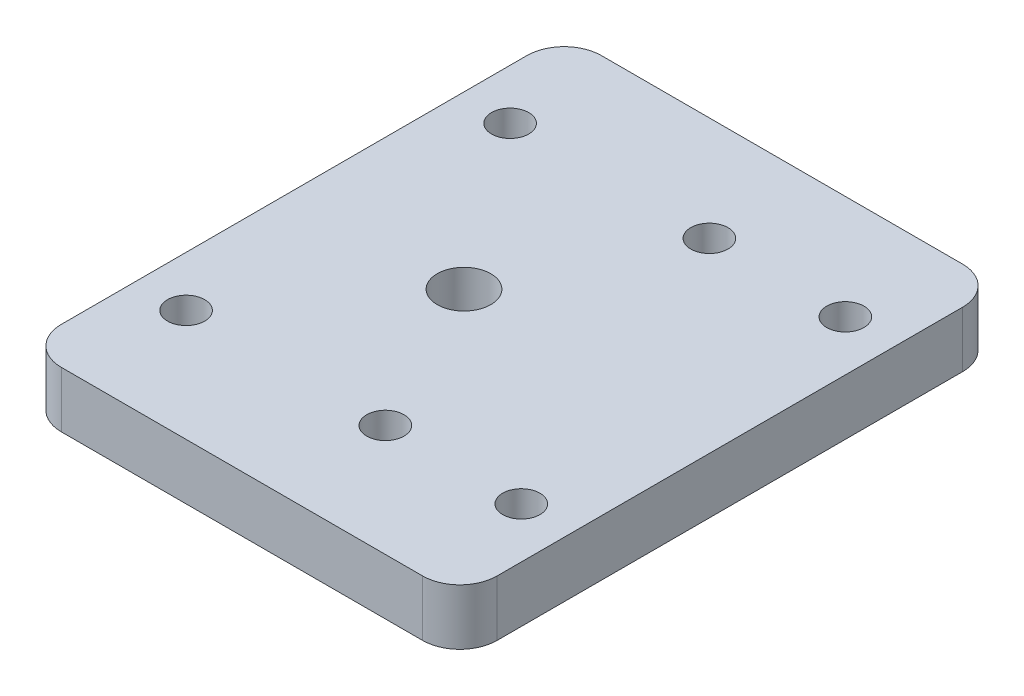
ISO-10303-21;
HEADER;
FILE_DESCRIPTION(('STEP AP214'),'2;1');
FILE_NAME('part.step','',(''),(''),'','','');
FILE_SCHEMA(('AUTOMOTIVE_DESIGN { 1 0 10303 214 1 1 1 1 }'));
ENDSEC;
DATA;
#1=APPLICATION_CONTEXT('core data for automotive mechanical design processes');
#2=APPLICATION_PROTOCOL_DEFINITION('international standard','automotive_design',2000,#1);
#3=PRODUCT_CONTEXT('',#1,'mechanical');
#4=PRODUCT('Part','Part','',(#3));
#5=PRODUCT_RELATED_PRODUCT_CATEGORY('part','',(#4));
#6=PRODUCT_DEFINITION_FORMATION('','',#4);
#7=PRODUCT_DEFINITION_CONTEXT('part definition',#1,'design');
#8=PRODUCT_DEFINITION('design','',#6,#7);
#9=PRODUCT_DEFINITION_SHAPE('','',#8);
#10=(LENGTH_UNIT() NAMED_UNIT(*) SI_UNIT(.MILLI.,.METRE.));
#11=(NAMED_UNIT(*) PLANE_ANGLE_UNIT() SI_UNIT($,.RADIAN.));
#12=(NAMED_UNIT(*) SI_UNIT($,.STERADIAN.) SOLID_ANGLE_UNIT());
#13=UNCERTAINTY_MEASURE_WITH_UNIT(LENGTH_MEASURE(1.E-05),#10,'distance_accuracy_value','');
#14=(GEOMETRIC_REPRESENTATION_CONTEXT(3) GLOBAL_UNCERTAINTY_ASSIGNED_CONTEXT((#13)) GLOBAL_UNIT_ASSIGNED_CONTEXT((#10,
#11,#12)) REPRESENTATION_CONTEXT('',''));
#15=CARTESIAN_POINT('',(0.,0.,0.));
#16=DIRECTION('',(0.,0.,1.));
#17=DIRECTION('',(1.,0.,0.));
#18=AXIS2_PLACEMENT_3D('',#15,#16,#17);
#19=CARTESIAN_POINT('',(0.,3.,0.));
#20=DIRECTION('',(0.,-1.,0.));
#21=DIRECTION('',(0.,0.,-1.));
#22=AXIS2_PLACEMENT_3D('',#19,#20,#21);
#23=PLANE('',#22);
#24=CARTESIAN_POINT('',(-2.52398418704892,3.,0.0532018004494109));
#25=DIRECTION('',(0.,1.,0.));
#26=DIRECTION('',(0.,0.,1.));
#27=AXIS2_PLACEMENT_3D('',#24,#25,#26);
#28=CIRCLE('',#27,1.44);
#29=CARTESIAN_POINT('',(-2.52398418704892,3.,1.49320180044941));
#30=VERTEX_POINT('',#29);
#31=EDGE_CURVE('E209',#30,#30,#28,.T.);
#32=ORIENTED_EDGE('',*,*,#31,.F.);
#33=EDGE_LOOP('',(#32));
#34=FACE_BOUND('',#33,.T.);
#35=CARTESIAN_POINT('',(-9.,3.,-8.9));
#36=DIRECTION('',(0.,1.,0.));
#37=DIRECTION('',(0.,0.,1.));
#38=AXIS2_PLACEMENT_3D('',#35,#36,#37);
#39=CIRCLE('',#38,1.);
#40=CARTESIAN_POINT('',(-9.,3.,-7.9));
#41=VERTEX_POINT('',#40);
#42=EDGE_CURVE('E195',#41,#41,#39,.T.);
#43=ORIENTED_EDGE('',*,*,#42,.F.);
#44=EDGE_LOOP('',(#43));
#45=FACE_BOUND('',#44,.T.);
#46=CARTESIAN_POINT('',(1.7,3.,-8.9));
#47=DIRECTION('',(0.,1.,0.));
#48=DIRECTION('',(0.,0.,1.));
#49=AXIS2_PLACEMENT_3D('',#46,#47,#48);
#50=CIRCLE('',#49,1.);
#51=CARTESIAN_POINT('',(1.7,3.,-7.9));
#52=VERTEX_POINT('',#51);
#53=EDGE_CURVE('E192',#52,#52,#50,.T.);
#54=ORIENTED_EDGE('',*,*,#53,.F.);
#55=EDGE_LOOP('',(#54));
#56=FACE_BOUND('',#55,.T.);
#57=CARTESIAN_POINT('',(9.,3.,-8.9));
#58=DIRECTION('',(0.,1.,0.));
#59=DIRECTION('',(0.,0.,1.));
#60=AXIS2_PLACEMENT_3D('',#57,#58,#59);
#61=CIRCLE('',#60,1.);
#62=CARTESIAN_POINT('',(9.,3.,-7.9));
#63=VERTEX_POINT('',#62);
#64=EDGE_CURVE('E220',#63,#63,#61,.T.);
#65=ORIENTED_EDGE('',*,*,#64,.F.);
#66=EDGE_LOOP('',(#65));
#67=FACE_BOUND('',#66,.T.);
#68=CARTESIAN_POINT('',(9.,3.,8.5));
#69=DIRECTION('',(0.,1.,0.));
#70=DIRECTION('',(0.,0.,-1.));
#71=AXIS2_PLACEMENT_3D('',#68,#69,#70);
#72=CIRCLE('',#71,1.);
#73=CARTESIAN_POINT('',(9.,3.,7.5));
#74=VERTEX_POINT('',#73);
#75=EDGE_CURVE('E147',#74,#74,#72,.T.);
#76=ORIENTED_EDGE('',*,*,#75,.F.);
#77=EDGE_LOOP('',(#76));
#78=FACE_BOUND('',#77,.T.);
#79=DIRECTION('',(0.,0.,-1.));
#80=VECTOR('',#79,1.);
#81=CARTESIAN_POINT('',(11.7,3.,14.5));
#82=LINE('',#81,#80);
#83=CARTESIAN_POINT('',(11.7,3.,12.5));
#84=VERTEX_POINT('',#83);
#85=CARTESIAN_POINT('',(11.7,3.,-12.5));
#86=VERTEX_POINT('',#85);
#87=EDGE_CURVE('E153',#84,#86,#82,.T.);
#88=ORIENTED_EDGE('',*,*,#87,.T.);
#89=CARTESIAN_POINT('',(9.69999999999999,3.,-12.5));
#90=DIRECTION('',(0.,-1.,0.));
#91=DIRECTION('',(0.,0.,-1.));
#92=AXIS2_PLACEMENT_3D('',#89,#90,#91);
#93=CIRCLE('',#92,2.);
#94=CARTESIAN_POINT('',(9.69999999999999,3.,-14.5));
#95=VERTEX_POINT('',#94);
#96=EDGE_CURVE('E177',#86,#95,#93,.F.);
#97=ORIENTED_EDGE('',*,*,#96,.T.);
#98=DIRECTION('',(-1.,0.,0.));
#99=VECTOR('',#98,1.);
#100=CARTESIAN_POINT('',(-11.7,3.,-14.5));
#101=LINE('',#100,#99);
#102=CARTESIAN_POINT('',(-9.7,3.,-14.5));
#103=VERTEX_POINT('',#102);
#104=EDGE_CURVE('E128',#95,#103,#101,.T.);
#105=ORIENTED_EDGE('',*,*,#104,.T.);
#106=CARTESIAN_POINT('',(-9.7,3.,-12.5));
#107=DIRECTION('',(0.,-1.,0.));
#108=DIRECTION('',(0.,0.,-1.));
#109=AXIS2_PLACEMENT_3D('',#106,#107,#108);
#110=CIRCLE('',#109,2.);
#111=CARTESIAN_POINT('',(-11.7,3.,-12.5));
#112=VERTEX_POINT('',#111);
#113=EDGE_CURVE('E169',#103,#112,#110,.F.);
#114=ORIENTED_EDGE('',*,*,#113,.T.);
#115=DIRECTION('',(0.,0.,1.));
#116=VECTOR('',#115,1.);
#117=CARTESIAN_POINT('',(-11.7,3.,14.5));
#118=LINE('',#117,#116);
#119=CARTESIAN_POINT('',(-11.7,3.,12.5));
#120=VERTEX_POINT('',#119);
#121=EDGE_CURVE('E247',#112,#120,#118,.T.);
#122=ORIENTED_EDGE('',*,*,#121,.T.);
#123=CARTESIAN_POINT('',(-9.7,3.,12.5));
#124=DIRECTION('',(0.,-1.,0.));
#125=DIRECTION('',(0.,0.,-1.));
#126=AXIS2_PLACEMENT_3D('',#123,#124,#125);
#127=CIRCLE('',#126,2.);
#128=CARTESIAN_POINT('',(-9.7,3.,14.5));
#129=VERTEX_POINT('',#128);
#130=EDGE_CURVE('E63',#120,#129,#127,.F.);
#131=ORIENTED_EDGE('',*,*,#130,.T.);
#132=DIRECTION('',(1.,0.,0.));
#133=VECTOR('',#132,1.);
#134=CARTESIAN_POINT('',(-11.7,3.,14.5));
#135=LINE('',#134,#133);
#136=CARTESIAN_POINT('',(9.69999999999999,3.,14.5));
#137=VERTEX_POINT('',#136);
#138=EDGE_CURVE('E155',#129,#137,#135,.T.);
#139=ORIENTED_EDGE('',*,*,#138,.T.);
#140=CARTESIAN_POINT('',(9.7,3.,12.5));
#141=DIRECTION('',(0.,-1.,0.));
#142=DIRECTION('',(0.,0.,-1.));
#143=AXIS2_PLACEMENT_3D('',#140,#141,#142);
#144=CIRCLE('',#143,2.);
#145=EDGE_CURVE('E174',#137,#84,#144,.F.);
#146=ORIENTED_EDGE('',*,*,#145,.T.);
#147=EDGE_LOOP('',(#88,#97,#105,#114,#122,#131,#139,#146));
#148=FACE_BOUND('',#147,.T.);
#149=CARTESIAN_POINT('',(-9.,3.,8.5));
#150=DIRECTION('',(0.,1.,0.));
#151=DIRECTION('',(0.,0.,-1.));
#152=AXIS2_PLACEMENT_3D('',#149,#150,#151);
#153=CIRCLE('',#152,1.);
#154=CARTESIAN_POINT('',(-9.,3.,7.5));
#155=VERTEX_POINT('',#154);
#156=EDGE_CURVE('E228',#155,#155,#153,.T.);
#157=ORIENTED_EDGE('',*,*,#156,.F.);
#158=EDGE_LOOP('',(#157));
#159=FACE_BOUND('',#158,.T.);
#160=CARTESIAN_POINT('',(1.7,3.,8.5));
#161=DIRECTION('',(0.,1.,0.));
#162=DIRECTION('',(0.,0.,-1.));
#163=AXIS2_PLACEMENT_3D('',#160,#161,#162);
#164=CIRCLE('',#163,1.);
#165=CARTESIAN_POINT('',(1.7,3.,7.5));
#166=VERTEX_POINT('',#165);
#167=EDGE_CURVE('E212',#166,#166,#164,.T.);
#168=ORIENTED_EDGE('',*,*,#167,.F.);
#169=EDGE_LOOP('',(#168));
#170=FACE_BOUND('',#169,.T.);
#171=ADVANCED_FACE('F38',(#34,#45,#56,#67,#78,#148,#159,#170),#23,.F.);
#172=CARTESIAN_POINT('',(0.,0.,0.));
#173=DIRECTION('',(0.,-1.,0.));
#174=DIRECTION('',(0.,0.,-1.));
#175=AXIS2_PLACEMENT_3D('',#172,#173,#174);
#176=PLANE('',#175);
#177=CARTESIAN_POINT('',(-2.52398418704892,0.,0.0532018004494109));
#178=DIRECTION('',(0.,-1.,0.));
#179=DIRECTION('',(0.,0.,-1.));
#180=AXIS2_PLACEMENT_3D('',#177,#178,#179);
#181=CIRCLE('',#180,1.44);
#182=CARTESIAN_POINT('',(-2.52398418704892,0.,-1.38679819955059));
#183=VERTEX_POINT('',#182);
#184=EDGE_CURVE('E42',#183,#183,#181,.T.);
#185=ORIENTED_EDGE('',*,*,#184,.F.);
#186=EDGE_LOOP('',(#185));
#187=FACE_BOUND('',#186,.T.);
#188=CARTESIAN_POINT('',(-9.,0.,-8.9));
#189=DIRECTION('',(0.,-1.,0.));
#190=DIRECTION('',(0.,0.,-1.));
#191=AXIS2_PLACEMENT_3D('',#188,#189,#190);
#192=CIRCLE('',#191,1.);
#193=CARTESIAN_POINT('',(-9.,0.,-9.9));
#194=VERTEX_POINT('',#193);
#195=EDGE_CURVE('E193',#194,#194,#192,.T.);
#196=ORIENTED_EDGE('',*,*,#195,.F.);
#197=EDGE_LOOP('',(#196));
#198=FACE_BOUND('',#197,.T.);
#199=CARTESIAN_POINT('',(1.7,0.,-8.9));
#200=DIRECTION('',(0.,-1.,0.));
#201=DIRECTION('',(0.,0.,-1.));
#202=AXIS2_PLACEMENT_3D('',#199,#200,#201);
#203=CIRCLE('',#202,1.);
#204=CARTESIAN_POINT('',(1.7,0.,-9.9));
#205=VERTEX_POINT('',#204);
#206=EDGE_CURVE('E188',#205,#205,#203,.T.);
#207=ORIENTED_EDGE('',*,*,#206,.F.);
#208=EDGE_LOOP('',(#207));
#209=FACE_BOUND('',#208,.T.);
#210=CARTESIAN_POINT('',(9.,0.,-8.9));
#211=DIRECTION('',(0.,1.,0.));
#212=DIRECTION('',(0.,0.,1.));
#213=AXIS2_PLACEMENT_3D('',#210,#211,#212);
#214=CIRCLE('',#213,1.);
#215=CARTESIAN_POINT('',(9.,0.,-7.9));
#216=VERTEX_POINT('',#215);
#217=EDGE_CURVE('E216',#216,#216,#214,.T.);
#218=ORIENTED_EDGE('',*,*,#217,.T.);
#219=EDGE_LOOP('',(#218));
#220=FACE_BOUND('',#219,.T.);
#221=CARTESIAN_POINT('',(9.,0.,8.5));
#222=DIRECTION('',(0.,1.,0.));
#223=DIRECTION('',(0.,0.,-1.));
#224=AXIS2_PLACEMENT_3D('',#221,#222,#223);
#225=CIRCLE('',#224,1.);
#226=CARTESIAN_POINT('',(9.,0.,7.5));
#227=VERTEX_POINT('',#226);
#228=EDGE_CURVE('E232',#227,#227,#225,.T.);
#229=ORIENTED_EDGE('',*,*,#228,.T.);
#230=EDGE_LOOP('',(#229));
#231=FACE_BOUND('',#230,.T.);
#232=DIRECTION('',(-1.,0.,0.));
#233=VECTOR('',#232,1.);
#234=CARTESIAN_POINT('',(-11.7,0.,-14.5));
#235=LINE('',#234,#233);
#236=CARTESIAN_POINT('',(9.69999999999999,0.,-14.5));
#237=VERTEX_POINT('',#236);
#238=CARTESIAN_POINT('',(-9.7,0.,-14.5));
#239=VERTEX_POINT('',#238);
#240=EDGE_CURVE('E125',#237,#239,#235,.T.);
#241=ORIENTED_EDGE('',*,*,#240,.F.);
#242=CARTESIAN_POINT('',(9.69999999999999,0.,-12.5));
#243=DIRECTION('',(0.,-1.,0.));
#244=DIRECTION('',(0.,0.,-1.));
#245=AXIS2_PLACEMENT_3D('',#242,#243,#244);
#246=CIRCLE('',#245,2.);
#247=CARTESIAN_POINT('',(11.7,0.,-12.5));
#248=VERTEX_POINT('',#247);
#249=EDGE_CURVE('E107',#237,#248,#246,.T.);
#250=ORIENTED_EDGE('',*,*,#249,.T.);
#251=DIRECTION('',(0.,0.,-1.));
#252=VECTOR('',#251,1.);
#253=CARTESIAN_POINT('',(11.7,0.,14.5));
#254=LINE('',#253,#252);
#255=CARTESIAN_POINT('',(11.7,0.,12.5));
#256=VERTEX_POINT('',#255);
#257=EDGE_CURVE('E138',#256,#248,#254,.T.);
#258=ORIENTED_EDGE('',*,*,#257,.F.);
#259=CARTESIAN_POINT('',(9.7,0.,12.5));
#260=DIRECTION('',(0.,-1.,0.));
#261=DIRECTION('',(0.,0.,-1.));
#262=AXIS2_PLACEMENT_3D('',#259,#260,#261);
#263=CIRCLE('',#262,2.);
#264=CARTESIAN_POINT('',(9.69999999999999,0.,14.5));
#265=VERTEX_POINT('',#264);
#266=EDGE_CURVE('E119',#256,#265,#263,.T.);
#267=ORIENTED_EDGE('',*,*,#266,.T.);
#268=DIRECTION('',(1.,0.,0.));
#269=VECTOR('',#268,1.);
#270=CARTESIAN_POINT('',(-11.7,0.,14.5));
#271=LINE('',#270,#269);
#272=CARTESIAN_POINT('',(-9.7,0.,14.5));
#273=VERTEX_POINT('',#272);
#274=EDGE_CURVE('E144',#273,#265,#271,.T.);
#275=ORIENTED_EDGE('',*,*,#274,.F.);
#276=CARTESIAN_POINT('',(-9.7,0.,12.5));
#277=DIRECTION('',(0.,-1.,0.));
#278=DIRECTION('',(0.,0.,-1.));
#279=AXIS2_PLACEMENT_3D('',#276,#277,#278);
#280=CIRCLE('',#279,2.);
#281=CARTESIAN_POINT('',(-11.7,0.,12.5));
#282=VERTEX_POINT('',#281);
#283=EDGE_CURVE('E159',#273,#282,#280,.T.);
#284=ORIENTED_EDGE('',*,*,#283,.T.);
#285=DIRECTION('',(0.,0.,1.));
#286=VECTOR('',#285,1.);
#287=CARTESIAN_POINT('',(-11.7,0.,14.5));
#288=LINE('',#287,#286);
#289=CARTESIAN_POINT('',(-11.7,0.,-12.5));
#290=VERTEX_POINT('',#289);
#291=EDGE_CURVE('E137',#290,#282,#288,.T.);
#292=ORIENTED_EDGE('',*,*,#291,.F.);
#293=CARTESIAN_POINT('',(-9.7,0.,-12.5));
#294=DIRECTION('',(0.,-1.,0.));
#295=DIRECTION('',(0.,0.,-1.));
#296=AXIS2_PLACEMENT_3D('',#293,#294,#295);
#297=CIRCLE('',#296,2.);
#298=EDGE_CURVE('E130',#290,#239,#297,.T.);
#299=ORIENTED_EDGE('',*,*,#298,.T.);
#300=EDGE_LOOP('',(#241,#250,#258,#267,#275,#284,#292,#299));
#301=FACE_BOUND('',#300,.T.);
#302=CARTESIAN_POINT('',(-9.,0.,8.5));
#303=DIRECTION('',(0.,1.,0.));
#304=DIRECTION('',(0.,0.,-1.));
#305=AXIS2_PLACEMENT_3D('',#302,#303,#304);
#306=CIRCLE('',#305,1.);
#307=CARTESIAN_POINT('',(-9.,0.,7.5));
#308=VERTEX_POINT('',#307);
#309=EDGE_CURVE('E224',#308,#308,#306,.T.);
#310=ORIENTED_EDGE('',*,*,#309,.T.);
#311=EDGE_LOOP('',(#310));
#312=FACE_BOUND('',#311,.T.);
#313=CARTESIAN_POINT('',(1.7,0.,8.5));
#314=DIRECTION('',(0.,1.,0.));
#315=DIRECTION('',(0.,0.,-1.));
#316=AXIS2_PLACEMENT_3D('',#313,#314,#315);
#317=CIRCLE('',#316,1.);
#318=CARTESIAN_POINT('',(1.7,0.,7.5));
#319=VERTEX_POINT('',#318);
#320=EDGE_CURVE('E191',#319,#319,#317,.T.);
#321=ORIENTED_EDGE('',*,*,#320,.T.);
#322=EDGE_LOOP('',(#321));
#323=FACE_BOUND('',#322,.T.);
#324=ADVANCED_FACE('F133',(#187,#198,#209,#220,#231,#301,#312,#323),#176,.T.);
#325=CARTESIAN_POINT('',(11.7,3.,14.5));
#326=DIRECTION('',(-1.,0.,0.));
#327=DIRECTION('',(0.,0.,1.));
#328=AXIS2_PLACEMENT_3D('',#325,#326,#327);
#329=PLANE('',#328);
#330=ORIENTED_EDGE('',*,*,#257,.T.);
#331=DIRECTION('',(0.,-1.,0.));
#332=VECTOR('',#331,1.);
#333=CARTESIAN_POINT('',(11.7,3.,-12.5));
#334=LINE('',#333,#332);
#335=EDGE_CURVE('E112',#248,#86,#334,.F.);
#336=ORIENTED_EDGE('',*,*,#335,.T.);
#337=ORIENTED_EDGE('',*,*,#87,.F.);
#338=DIRECTION('',(0.,-1.,0.));
#339=VECTOR('',#338,1.);
#340=CARTESIAN_POINT('',(11.7,3.,12.5));
#341=LINE('',#340,#339);
#342=EDGE_CURVE('E118',#84,#256,#341,.T.);
#343=ORIENTED_EDGE('',*,*,#342,.T.);
#344=EDGE_LOOP('',(#330,#336,#337,#343));
#345=FACE_BOUND('',#344,.T.);
#346=ADVANCED_FACE('F257',(#345),#329,.F.);
#347=CARTESIAN_POINT('',(-11.7,3.,-14.5));
#348=DIRECTION('',(0.,0.,1.));
#349=DIRECTION('',(1.,0.,0.));
#350=AXIS2_PLACEMENT_3D('',#347,#348,#349);
#351=PLANE('',#350);
#352=ORIENTED_EDGE('',*,*,#104,.F.);
#353=DIRECTION('',(0.,-1.,0.));
#354=VECTOR('',#353,1.);
#355=CARTESIAN_POINT('',(9.69999999999999,3.,-14.5));
#356=LINE('',#355,#354);
#357=EDGE_CURVE('E111',#95,#237,#356,.T.);
#358=ORIENTED_EDGE('',*,*,#357,.T.);
#359=ORIENTED_EDGE('',*,*,#240,.T.);
#360=DIRECTION('',(0.,-1.,0.));
#361=VECTOR('',#360,1.);
#362=CARTESIAN_POINT('',(-9.7,3.,-14.5));
#363=LINE('',#362,#361);
#364=EDGE_CURVE('E131',#239,#103,#363,.F.);
#365=ORIENTED_EDGE('',*,*,#364,.T.);
#366=EDGE_LOOP('',(#352,#358,#359,#365));
#367=FACE_BOUND('',#366,.T.);
#368=ADVANCED_FACE('F124',(#367),#351,.F.);
#369=CARTESIAN_POINT('',(-11.7,3.,14.5));
#370=DIRECTION('',(1.,0.,0.));
#371=DIRECTION('',(0.,0.,-1.));
#372=AXIS2_PLACEMENT_3D('',#369,#370,#371);
#373=PLANE('',#372);
#374=ORIENTED_EDGE('',*,*,#291,.T.);
#375=DIRECTION('',(0.,-1.,0.));
#376=VECTOR('',#375,1.);
#377=CARTESIAN_POINT('',(-11.7,3.,12.5));
#378=LINE('',#377,#376);
#379=EDGE_CURVE('E11',#282,#120,#378,.F.);
#380=ORIENTED_EDGE('',*,*,#379,.T.);
#381=ORIENTED_EDGE('',*,*,#121,.F.);
#382=DIRECTION('',(0.,-1.,0.));
#383=VECTOR('',#382,1.);
#384=CARTESIAN_POINT('',(-11.7,3.,-12.5));
#385=LINE('',#384,#383);
#386=EDGE_CURVE('E48',#112,#290,#385,.T.);
#387=ORIENTED_EDGE('',*,*,#386,.T.);
#388=EDGE_LOOP('',(#374,#380,#381,#387));
#389=FACE_BOUND('',#388,.T.);
#390=ADVANCED_FACE('F264',(#389),#373,.F.);
#391=CARTESIAN_POINT('',(-11.7,3.,14.5));
#392=DIRECTION('',(0.,0.,-1.));
#393=DIRECTION('',(-1.,0.,0.));
#394=AXIS2_PLACEMENT_3D('',#391,#392,#393);
#395=PLANE('',#394);
#396=ORIENTED_EDGE('',*,*,#274,.T.);
#397=DIRECTION('',(0.,-1.,0.));
#398=VECTOR('',#397,1.);
#399=CARTESIAN_POINT('',(9.69999999999999,3.,14.5));
#400=LINE('',#399,#398);
#401=EDGE_CURVE('E56',#265,#137,#400,.F.);
#402=ORIENTED_EDGE('',*,*,#401,.T.);
#403=ORIENTED_EDGE('',*,*,#138,.F.);
#404=DIRECTION('',(0.,-1.,0.));
#405=VECTOR('',#404,1.);
#406=CARTESIAN_POINT('',(-9.7,3.,14.5));
#407=LINE('',#406,#405);
#408=EDGE_CURVE('E179',#129,#273,#407,.T.);
#409=ORIENTED_EDGE('',*,*,#408,.T.);
#410=EDGE_LOOP('',(#396,#402,#403,#409));
#411=FACE_BOUND('',#410,.T.);
#412=ADVANCED_FACE('F259',(#411),#395,.F.);
#413=CARTESIAN_POINT('',(9.,3.,8.5));
#414=DIRECTION('',(0.,-1.,0.));
#415=DIRECTION('',(0.,0.,-1.));
#416=AXIS2_PLACEMENT_3D('',#413,#414,#415);
#417=CYLINDRICAL_SURFACE('',#416,1.);
#418=ORIENTED_EDGE('',*,*,#75,.T.);
#419=EDGE_LOOP('',(#418));
#420=FACE_BOUND('',#419,.T.);
#421=ORIENTED_EDGE('',*,*,#228,.F.);
#422=EDGE_LOOP('',(#421));
#423=FACE_BOUND('',#422,.T.);
#424=ADVANCED_FACE('F289',(#420,#423),#417,.F.);
#425=CARTESIAN_POINT('',(-9.,3.,8.5));
#426=DIRECTION('',(0.,-1.,0.));
#427=DIRECTION('',(0.,0.,-1.));
#428=AXIS2_PLACEMENT_3D('',#425,#426,#427);
#429=CYLINDRICAL_SURFACE('',#428,1.);
#430=ORIENTED_EDGE('',*,*,#156,.T.);
#431=EDGE_LOOP('',(#430));
#432=FACE_BOUND('',#431,.T.);
#433=ORIENTED_EDGE('',*,*,#309,.F.);
#434=EDGE_LOOP('',(#433));
#435=FACE_BOUND('',#434,.T.);
#436=ADVANCED_FACE('F391',(#432,#435),#429,.F.);
#437=CARTESIAN_POINT('',(9.,3.,-8.9));
#438=DIRECTION('',(0.,-1.,0.));
#439=DIRECTION('',(0.,0.,-1.));
#440=AXIS2_PLACEMENT_3D('',#437,#438,#439);
#441=CYLINDRICAL_SURFACE('',#440,1.);
#442=ORIENTED_EDGE('',*,*,#64,.T.);
#443=EDGE_LOOP('',(#442));
#444=FACE_BOUND('',#443,.T.);
#445=ORIENTED_EDGE('',*,*,#217,.F.);
#446=EDGE_LOOP('',(#445));
#447=FACE_BOUND('',#446,.T.);
#448=ADVANCED_FACE('F380',(#444,#447),#441,.F.);
#449=CARTESIAN_POINT('',(1.7,3.,8.5));
#450=DIRECTION('',(0.,-1.,0.));
#451=DIRECTION('',(0.,0.,-1.));
#452=AXIS2_PLACEMENT_3D('',#449,#450,#451);
#453=CYLINDRICAL_SURFACE('',#452,1.);
#454=ORIENTED_EDGE('',*,*,#167,.T.);
#455=EDGE_LOOP('',(#454));
#456=FACE_BOUND('',#455,.T.);
#457=ORIENTED_EDGE('',*,*,#320,.F.);
#458=EDGE_LOOP('',(#457));
#459=FACE_BOUND('',#458,.T.);
#460=ADVANCED_FACE('F302',(#456,#459),#453,.F.);
#461=CARTESIAN_POINT('',(9.69999999999999,3.,-12.5));
#462=DIRECTION('',(0.,-1.,0.));
#463=DIRECTION('',(0.,0.,-1.));
#464=AXIS2_PLACEMENT_3D('',#461,#462,#463);
#465=CYLINDRICAL_SURFACE('',#464,2.);
#466=ORIENTED_EDGE('',*,*,#96,.F.);
#467=ORIENTED_EDGE('',*,*,#335,.F.);
#468=ORIENTED_EDGE('',*,*,#249,.F.);
#469=ORIENTED_EDGE('',*,*,#357,.F.);
#470=EDGE_LOOP('',(#466,#467,#468,#469));
#471=FACE_BOUND('',#470,.T.);
#472=ADVANCED_FACE('F110',(#471),#465,.T.);
#473=CARTESIAN_POINT('',(9.7,3.,12.5));
#474=DIRECTION('',(0.,-1.,0.));
#475=DIRECTION('',(0.,0.,-1.));
#476=AXIS2_PLACEMENT_3D('',#473,#474,#475);
#477=CYLINDRICAL_SURFACE('',#476,2.);
#478=ORIENTED_EDGE('',*,*,#145,.F.);
#479=ORIENTED_EDGE('',*,*,#401,.F.);
#480=ORIENTED_EDGE('',*,*,#266,.F.);
#481=ORIENTED_EDGE('',*,*,#342,.F.);
#482=EDGE_LOOP('',(#478,#479,#480,#481));
#483=FACE_BOUND('',#482,.T.);
#484=ADVANCED_FACE('F255',(#483),#477,.T.);
#485=CARTESIAN_POINT('',(-9.7,3.,12.5));
#486=DIRECTION('',(0.,-1.,0.));
#487=DIRECTION('',(0.,0.,-1.));
#488=AXIS2_PLACEMENT_3D('',#485,#486,#487);
#489=CYLINDRICAL_SURFACE('',#488,2.);
#490=ORIENTED_EDGE('',*,*,#130,.F.);
#491=ORIENTED_EDGE('',*,*,#379,.F.);
#492=ORIENTED_EDGE('',*,*,#283,.F.);
#493=ORIENTED_EDGE('',*,*,#408,.F.);
#494=EDGE_LOOP('',(#490,#491,#492,#493));
#495=FACE_BOUND('',#494,.T.);
#496=ADVANCED_FACE('F261',(#495),#489,.T.);
#497=CARTESIAN_POINT('',(-9.7,3.,-12.5));
#498=DIRECTION('',(0.,-1.,0.));
#499=DIRECTION('',(0.,0.,-1.));
#500=AXIS2_PLACEMENT_3D('',#497,#498,#499);
#501=CYLINDRICAL_SURFACE('',#500,2.);
#502=ORIENTED_EDGE('',*,*,#113,.F.);
#503=ORIENTED_EDGE('',*,*,#364,.F.);
#504=ORIENTED_EDGE('',*,*,#298,.F.);
#505=ORIENTED_EDGE('',*,*,#386,.F.);
#506=EDGE_LOOP('',(#502,#503,#504,#505));
#507=FACE_BOUND('',#506,.T.);
#508=ADVANCED_FACE('F40',(#507),#501,.T.);
#509=CARTESIAN_POINT('',(1.7,-7.,-8.9));
#510=DIRECTION('',(0.,1.,0.));
#511=DIRECTION('',(0.,0.,1.));
#512=AXIS2_PLACEMENT_3D('',#509,#510,#511);
#513=CYLINDRICAL_SURFACE('',#512,1.);
#514=ORIENTED_EDGE('',*,*,#206,.T.);
#515=EDGE_LOOP('',(#514));
#516=FACE_BOUND('',#515,.T.);
#517=ORIENTED_EDGE('',*,*,#53,.T.);
#518=EDGE_LOOP('',(#517));
#519=FACE_BOUND('',#518,.T.);
#520=ADVANCED_FACE('F270',(#516,#519),#513,.F.);
#521=CARTESIAN_POINT('',(-9.,-7.,-8.9));
#522=DIRECTION('',(0.,1.,0.));
#523=DIRECTION('',(0.,0.,1.));
#524=AXIS2_PLACEMENT_3D('',#521,#522,#523);
#525=CYLINDRICAL_SURFACE('',#524,1.);
#526=ORIENTED_EDGE('',*,*,#195,.T.);
#527=EDGE_LOOP('',(#526));
#528=FACE_BOUND('',#527,.T.);
#529=ORIENTED_EDGE('',*,*,#42,.T.);
#530=EDGE_LOOP('',(#529));
#531=FACE_BOUND('',#530,.T.);
#532=ADVANCED_FACE('F275',(#528,#531),#525,.F.);
#533=CARTESIAN_POINT('',(-2.52398418704892,-0.5,0.0532018004494109));
#534=DIRECTION('',(0.,1.,0.));
#535=DIRECTION('',(0.,0.,1.));
#536=AXIS2_PLACEMENT_3D('',#533,#534,#535);
#537=CYLINDRICAL_SURFACE('',#536,1.44);
#538=ORIENTED_EDGE('',*,*,#184,.T.);
#539=EDGE_LOOP('',(#538));
#540=FACE_BOUND('',#539,.T.);
#541=ORIENTED_EDGE('',*,*,#31,.T.);
#542=EDGE_LOOP('',(#541));
#543=FACE_BOUND('',#542,.T.);
#544=ADVANCED_FACE('F327',(#540,#543),#537,.F.);
#545=CLOSED_SHELL('',(#171,#324,#346,#368,#390,#412,#424,#436,#448,#460,#472,#484,#496,#508,
#520,#532,#544));
#546=MANIFOLD_SOLID_BREP('B2',#545);
#547=ADVANCED_BREP_SHAPE_REPRESENTATION('',(#18,#546),#14);
#548=SHAPE_DEFINITION_REPRESENTATION(#9,#547);
ENDSEC;
END-ISO-10303-21;
